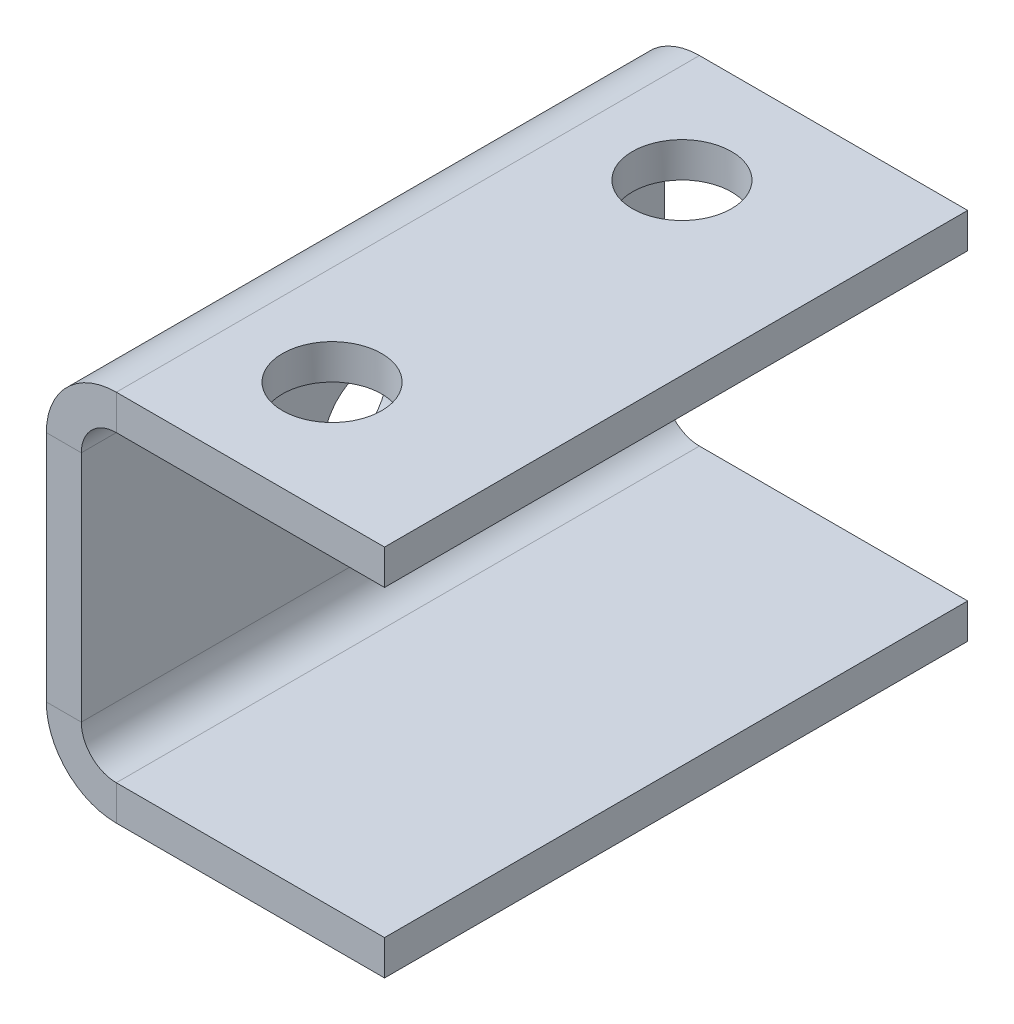
ISO-10303-21;
HEADER;
FILE_DESCRIPTION(('STEP AP214'),'2;1');
FILE_NAME('part.step','',(''),(''),'','','');
FILE_SCHEMA(('AUTOMOTIVE_DESIGN { 1 0 10303 214 1 1 1 1 }'));
ENDSEC;
DATA;
#1=APPLICATION_CONTEXT('core data for automotive mechanical design processes');
#2=APPLICATION_PROTOCOL_DEFINITION('international standard','automotive_design',2000,#1);
#3=PRODUCT_CONTEXT('',#1,'mechanical');
#4=PRODUCT('Part','Part','',(#3));
#5=PRODUCT_RELATED_PRODUCT_CATEGORY('part','',(#4));
#6=PRODUCT_DEFINITION_FORMATION('','',#4);
#7=PRODUCT_DEFINITION_CONTEXT('part definition',#1,'design');
#8=PRODUCT_DEFINITION('design','',#6,#7);
#9=PRODUCT_DEFINITION_SHAPE('','',#8);
#10=(LENGTH_UNIT() NAMED_UNIT(*) SI_UNIT(.MILLI.,.METRE.));
#11=(NAMED_UNIT(*) PLANE_ANGLE_UNIT() SI_UNIT($,.RADIAN.));
#12=(NAMED_UNIT(*) SI_UNIT($,.STERADIAN.) SOLID_ANGLE_UNIT());
#13=UNCERTAINTY_MEASURE_WITH_UNIT(LENGTH_MEASURE(1.E-05),#10,'distance_accuracy_value','');
#14=(GEOMETRIC_REPRESENTATION_CONTEXT(3) GLOBAL_UNCERTAINTY_ASSIGNED_CONTEXT((#13)) GLOBAL_UNIT_ASSIGNED_CONTEXT((#10,
#11,#12)) REPRESENTATION_CONTEXT('',''));
#15=CARTESIAN_POINT('',(0.,0.,0.));
#16=DIRECTION('',(0.,0.,1.));
#17=DIRECTION('',(1.,0.,0.));
#18=AXIS2_PLACEMENT_3D('',#15,#16,#17);
#19=CARTESIAN_POINT('',(6.00000000000012,-25.9999999999997,100.000000000002));
#20=DIRECTION('',(0.,0.,1.00000000000001));
#21=DIRECTION('',(1.,0.,0.));
#22=AXIS2_PLACEMENT_3D('',#19,#20,#21);
#23=PLANE('',#22);
#24=DIRECTION('',(0.,-1.,0.));
#25=VECTOR('',#24,1.);
#26=CARTESIAN_POINT('',(6.00000000000012,-25.9999999999997,100.000000000002));
#27=LINE('',#26,#25);
#28=CARTESIAN_POINT('',(6.00000000000012,-25.9999999999997,100.000000000002));
#29=VERTEX_POINT('',#28);
#30=CARTESIAN_POINT('',(6.00000000000012,-31.9999999999996,100.000000000002));
#31=VERTEX_POINT('',#30);
#32=EDGE_CURVE('E11',#29,#31,#27,.T.);
#33=ORIENTED_EDGE('',*,*,#32,.F.);
#34=CARTESIAN_POINT('',(6.00000000000012,-19.9999999999997,100.000000000002));
#35=DIRECTION('',(0.,0.,1.00000000000001));
#36=DIRECTION('',(1.,0.,0.));
#37=AXIS2_PLACEMENT_3D('',#34,#35,#36);
#38=CIRCLE('',#37,6.);
#39=CARTESIAN_POINT('',(1.11022302462516E-13,-19.9999999999996,100.000000000001));
#40=VERTEX_POINT('',#39);
#41=EDGE_CURVE('E150',#29,#40,#38,.F.);
#42=ORIENTED_EDGE('',*,*,#41,.T.);
#43=DIRECTION('',(1.,0.,0.));
#44=VECTOR('',#43,1.);
#45=CARTESIAN_POINT('',(-5.99999999999989,-19.9999999999996,100.000000000001));
#46=LINE('',#45,#44);
#47=CARTESIAN_POINT('',(-5.99999999999989,-19.9999999999996,100.000000000001));
#48=VERTEX_POINT('',#47);
#49=EDGE_CURVE('E48',#48,#40,#46,.T.);
#50=ORIENTED_EDGE('',*,*,#49,.F.);
#51=CARTESIAN_POINT('',(6.00000000000012,-19.9999999999997,100.000000000002));
#52=DIRECTION('',(0.,0.,1.00000000000001));
#53=DIRECTION('',(1.,0.,0.));
#54=AXIS2_PLACEMENT_3D('',#51,#52,#53);
#55=CIRCLE('',#54,12.);
#56=EDGE_CURVE('E245',#31,#48,#55,.F.);
#57=ORIENTED_EDGE('',*,*,#56,.F.);
#58=EDGE_LOOP('',(#33,#42,#50,#57));
#59=FACE_BOUND('',#58,.T.);
#60=ADVANCED_FACE('F40',(#59),#23,.T.);
#61=CARTESIAN_POINT('',(-5.99999999999989,-19.9999999999996,100.000000000001));
#62=DIRECTION('',(0.,0.,1.00000000000001));
#63=DIRECTION('',(1.,0.,0.));
#64=AXIS2_PLACEMENT_3D('',#61,#62,#63);
#65=PLANE('',#64);
#66=DIRECTION('',(-1.,0.,0.));
#67=VECTOR('',#66,1.);
#68=CARTESIAN_POINT('',(1.11022302462516E-13,-25.9999999999996,100.000000000002));
#69=LINE('',#68,#67);
#70=CARTESIAN_POINT('',(52.0000000000001,-25.9999999999999,100.));
#71=VERTEX_POINT('',#70);
#72=EDGE_CURVE('E155',#71,#29,#69,.T.);
#73=ORIENTED_EDGE('',*,*,#72,.T.);
#74=ORIENTED_EDGE('',*,*,#32,.T.);
#75=DIRECTION('',(1.,0.,0.));
#76=VECTOR('',#75,1.);
#77=CARTESIAN_POINT('',(1.11022302462516E-13,-31.9999999999996,100.000000000002));
#78=LINE('',#77,#76);
#79=CARTESIAN_POINT('',(52.0000000000001,-32.,100.));
#80=VERTEX_POINT('',#79);
#81=EDGE_CURVE('E258',#80,#31,#78,.F.);
#82=ORIENTED_EDGE('',*,*,#81,.F.);
#83=DIRECTION('',(0.,-1.,0.));
#84=VECTOR('',#83,1.);
#85=CARTESIAN_POINT('',(52.0000000000001,-25.9999999999999,100.));
#86=LINE('',#85,#84);
#87=EDGE_CURVE('E260',#71,#80,#86,.T.);
#88=ORIENTED_EDGE('',*,*,#87,.F.);
#89=EDGE_LOOP('',(#73,#74,#82,#88));
#90=FACE_BOUND('',#89,.T.);
#91=ADVANCED_FACE('F271',(#90),#65,.T.);
#92=CARTESIAN_POINT('',(1.11022302462516E-13,-19.9999999999999,1.11022302462516E-13));
#93=DIRECTION('',(0.,0.,-1.00000000000001));
#94=DIRECTION('',(-1.,0.,0.));
#95=AXIS2_PLACEMENT_3D('',#92,#93,#94);
#96=PLANE('',#95);
#97=DIRECTION('',(-1.,0.,0.));
#98=VECTOR('',#97,1.);
#99=CARTESIAN_POINT('',(1.11022302462516E-13,-19.9999999999999,1.11022302462516E-13));
#100=LINE('',#99,#98);
#101=CARTESIAN_POINT('',(1.11022302462516E-13,-19.9999999999999,1.11022302462516E-13));
#102=VERTEX_POINT('',#101);
#103=CARTESIAN_POINT('',(-5.99999999999989,-19.9999999999999,1.0547118733939E-12));
#104=VERTEX_POINT('',#103);
#105=EDGE_CURVE('E148',#102,#104,#100,.T.);
#106=ORIENTED_EDGE('',*,*,#105,.F.);
#107=CARTESIAN_POINT('',(6.00000000000012,-20.,1.11022302462516E-13));
#108=DIRECTION('',(0.,0.,1.00000000000001));
#109=DIRECTION('',(1.,0.,0.));
#110=AXIS2_PLACEMENT_3D('',#107,#108,#109);
#111=CIRCLE('',#110,6.);
#112=CARTESIAN_POINT('',(6.00000000000012,-26.,1.11022302462516E-13));
#113=VERTEX_POINT('',#112);
#114=EDGE_CURVE('E162',#113,#102,#111,.F.);
#115=ORIENTED_EDGE('',*,*,#114,.F.);
#116=DIRECTION('',(0.,1.,0.));
#117=VECTOR('',#116,1.);
#118=CARTESIAN_POINT('',(6.00000000000012,-32.,1.11022302462516E-13));
#119=LINE('',#118,#117);
#120=CARTESIAN_POINT('',(6.00000000000012,-32.,1.11022302462516E-13));
#121=VERTEX_POINT('',#120);
#122=EDGE_CURVE('E236',#121,#113,#119,.T.);
#123=ORIENTED_EDGE('',*,*,#122,.F.);
#124=CARTESIAN_POINT('',(6.00000000000012,-20.,1.11022302462516E-13));
#125=DIRECTION('',(0.,0.,1.00000000000001));
#126=DIRECTION('',(1.,0.,0.));
#127=AXIS2_PLACEMENT_3D('',#124,#125,#126);
#128=CIRCLE('',#127,12.);
#129=EDGE_CURVE('E190',#121,#104,#128,.F.);
#130=ORIENTED_EDGE('',*,*,#129,.T.);
#131=EDGE_LOOP('',(#106,#115,#123,#130));
#132=FACE_BOUND('',#131,.T.);
#133=ADVANCED_FACE('F250',(#132),#96,.T.);
#134=CARTESIAN_POINT('',(6.00000000000012,-32.,1.11022302462516E-13));
#135=DIRECTION('',(0.,0.,-1.00000000000001));
#136=DIRECTION('',(-1.,0.,0.));
#137=AXIS2_PLACEMENT_3D('',#134,#135,#136);
#138=PLANE('',#137);
#139=DIRECTION('',(0.,1.,0.));
#140=VECTOR('',#139,1.);
#141=CARTESIAN_POINT('',(-6.66133814775094E-13,26.,0.));
#142=LINE('',#141,#140);
#143=CARTESIAN_POINT('',(0.,20.,0.));
#144=VERTEX_POINT('',#143);
#145=EDGE_CURVE('E203',#102,#144,#142,.T.);
#146=ORIENTED_EDGE('',*,*,#145,.F.);
#147=ORIENTED_EDGE('',*,*,#105,.T.);
#148=DIRECTION('',(0.,1.,0.));
#149=VECTOR('',#148,1.);
#150=CARTESIAN_POINT('',(-6.00000000000067,26.,2.77555756156289E-13));
#151=LINE('',#150,#149);
#152=CARTESIAN_POINT('',(-6.00000000000006,20.,2.77555756156289E-13));
#153=VERTEX_POINT('',#152);
#154=EDGE_CURVE('E188',#104,#153,#151,.T.);
#155=ORIENTED_EDGE('',*,*,#154,.T.);
#156=DIRECTION('',(1.,0.,0.));
#157=VECTOR('',#156,1.);
#158=CARTESIAN_POINT('',(-6.00000000000006,20.,2.77555756156289E-13));
#159=LINE('',#158,#157);
#160=EDGE_CURVE('E97',#153,#144,#159,.T.);
#161=ORIENTED_EDGE('',*,*,#160,.T.);
#162=EDGE_LOOP('',(#146,#147,#155,#161));
#163=FACE_BOUND('',#162,.T.);
#164=ADVANCED_FACE('F238',(#163),#138,.T.);
#165=CARTESIAN_POINT('',(0.,20.0000000000004,99.9999999999999));
#166=DIRECTION('',(0.,0.,1.00000000000001));
#167=DIRECTION('',(1.,0.,0.));
#168=AXIS2_PLACEMENT_3D('',#165,#166,#167);
#169=PLANE('',#168);
#170=DIRECTION('',(-1.,0.,0.));
#171=VECTOR('',#170,1.);
#172=CARTESIAN_POINT('',(0.,20.0000000000004,99.9999999999999));
#173=LINE('',#172,#171);
#174=CARTESIAN_POINT('',(0.,20.0000000000004,99.9999999999999));
#175=VERTEX_POINT('',#174);
#176=CARTESIAN_POINT('',(-6.00000000000001,20.0000000000004,99.9999999999999));
#177=VERTEX_POINT('',#176);
#178=EDGE_CURVE('E234',#175,#177,#173,.T.);
#179=ORIENTED_EDGE('',*,*,#178,.F.);
#180=CARTESIAN_POINT('',(6.00000000000001,20.0000000000004,100.));
#181=DIRECTION('',(0.,0.,1.00000000000001));
#182=DIRECTION('',(1.,0.,0.));
#183=AXIS2_PLACEMENT_3D('',#180,#181,#182);
#184=CIRCLE('',#183,6.);
#185=CARTESIAN_POINT('',(5.99999999999939,26.0000000000004,100.));
#186=VERTEX_POINT('',#185);
#187=EDGE_CURVE('E170',#175,#186,#184,.F.);
#188=ORIENTED_EDGE('',*,*,#187,.T.);
#189=DIRECTION('',(0.,-1.,0.));
#190=VECTOR('',#189,1.);
#191=CARTESIAN_POINT('',(5.99999999999939,32.0000000000004,100.));
#192=LINE('',#191,#190);
#193=CARTESIAN_POINT('',(5.99999999999939,32.0000000000004,100.));
#194=VERTEX_POINT('',#193);
#195=EDGE_CURVE('E56',#194,#186,#192,.T.);
#196=ORIENTED_EDGE('',*,*,#195,.F.);
#197=CARTESIAN_POINT('',(6.00000000000001,20.0000000000004,100.));
#198=DIRECTION('',(0.,0.,1.00000000000001));
#199=DIRECTION('',(1.,0.,0.));
#200=AXIS2_PLACEMENT_3D('',#197,#198,#199);
#201=CIRCLE('',#200,12.);
#202=EDGE_CURVE('E262',#177,#194,#201,.F.);
#203=ORIENTED_EDGE('',*,*,#202,.F.);
#204=EDGE_LOOP('',(#179,#188,#196,#203));
#205=FACE_BOUND('',#204,.T.);
#206=ADVANCED_FACE('F297',(#205),#169,.T.);
#207=CARTESIAN_POINT('',(5.99999999999939,32.0000000000004,100.));
#208=DIRECTION('',(0.,0.,1.00000000000001));
#209=DIRECTION('',(1.,0.,0.));
#210=AXIS2_PLACEMENT_3D('',#207,#208,#209);
#211=PLANE('',#210);
#212=DIRECTION('',(0.,1.,0.));
#213=VECTOR('',#212,1.);
#214=CARTESIAN_POINT('',(-6.10622663543836E-13,26.0000000000004,100.));
#215=LINE('',#214,#213);
#216=EDGE_CURVE('E140',#40,#175,#215,.T.);
#217=ORIENTED_EDGE('',*,*,#216,.T.);
#218=ORIENTED_EDGE('',*,*,#178,.T.);
#219=DIRECTION('',(0.,1.,0.));
#220=VECTOR('',#219,1.);
#221=CARTESIAN_POINT('',(-6.00000000000062,26.0000000000004,99.9999999999999));
#222=LINE('',#221,#220);
#223=EDGE_CURVE('E143',#48,#177,#222,.T.);
#224=ORIENTED_EDGE('',*,*,#223,.F.);
#225=ORIENTED_EDGE('',*,*,#49,.T.);
#226=EDGE_LOOP('',(#217,#218,#224,#225));
#227=FACE_BOUND('',#226,.T.);
#228=ADVANCED_FACE('F138',(#227),#211,.T.);
#229=CARTESIAN_POINT('',(5.99999999999934,26.,0.));
#230=DIRECTION('',(0.,0.,-1.00000000000001));
#231=DIRECTION('',(-1.,0.,0.));
#232=AXIS2_PLACEMENT_3D('',#229,#230,#231);
#233=PLANE('',#232);
#234=DIRECTION('',(0.,1.,0.));
#235=VECTOR('',#234,1.);
#236=CARTESIAN_POINT('',(5.99999999999934,26.,0.));
#237=LINE('',#236,#235);
#238=CARTESIAN_POINT('',(5.99999999999934,26.,0.));
#239=VERTEX_POINT('',#238);
#240=CARTESIAN_POINT('',(5.99999999999934,32.,0.));
#241=VERTEX_POINT('',#240);
#242=EDGE_CURVE('E104',#239,#241,#237,.T.);
#243=ORIENTED_EDGE('',*,*,#242,.F.);
#244=CARTESIAN_POINT('',(5.99999999999995,20.,0.));
#245=DIRECTION('',(0.,0.,1.00000000000001));
#246=DIRECTION('',(1.,0.,0.));
#247=AXIS2_PLACEMENT_3D('',#244,#245,#246);
#248=CIRCLE('',#247,6.);
#249=EDGE_CURVE('E205',#144,#239,#248,.F.);
#250=ORIENTED_EDGE('',*,*,#249,.F.);
#251=ORIENTED_EDGE('',*,*,#160,.F.);
#252=CARTESIAN_POINT('',(5.99999999999995,20.,0.));
#253=DIRECTION('',(0.,0.,1.00000000000001));
#254=DIRECTION('',(1.,0.,0.));
#255=AXIS2_PLACEMENT_3D('',#252,#253,#254);
#256=CIRCLE('',#255,12.);
#257=EDGE_CURVE('E186',#153,#241,#256,.F.);
#258=ORIENTED_EDGE('',*,*,#257,.T.);
#259=EDGE_LOOP('',(#243,#250,#251,#258));
#260=FACE_BOUND('',#259,.T.);
#261=ADVANCED_FACE('F303',(#260),#233,.T.);
#262=CARTESIAN_POINT('',(-6.00000000000006,20.,2.77555756156289E-13));
#263=DIRECTION('',(0.,0.,-1.00000000000001));
#264=DIRECTION('',(-1.,0.,0.));
#265=AXIS2_PLACEMENT_3D('',#262,#263,#264);
#266=PLANE('',#265);
#267=DIRECTION('',(1.,0.,0.));
#268=VECTOR('',#267,1.);
#269=CARTESIAN_POINT('',(-6.66133814775094E-13,26.,0.));
#270=LINE('',#269,#268);
#271=CARTESIAN_POINT('',(51.9999999999993,25.9999999999997,8.32667268468867E-13));
#272=VERTEX_POINT('',#271);
#273=EDGE_CURVE('E176',#239,#272,#270,.T.);
#274=ORIENTED_EDGE('',*,*,#273,.F.);
#275=ORIENTED_EDGE('',*,*,#242,.T.);
#276=DIRECTION('',(1.,0.,0.));
#277=VECTOR('',#276,1.);
#278=CARTESIAN_POINT('',(-6.66133814775094E-13,32.,0.));
#279=LINE('',#278,#277);
#280=CARTESIAN_POINT('',(51.9999999999993,31.9999999999997,8.32667268468867E-13));
#281=VERTEX_POINT('',#280);
#282=EDGE_CURVE('E183',#241,#281,#279,.T.);
#283=ORIENTED_EDGE('',*,*,#282,.T.);
#284=DIRECTION('',(0.,-1.,0.));
#285=VECTOR('',#284,1.);
#286=CARTESIAN_POINT('',(51.9999999999993,31.9999999999997,8.32667268468867E-13));
#287=LINE('',#286,#285);
#288=EDGE_CURVE('E179',#281,#272,#287,.T.);
#289=ORIENTED_EDGE('',*,*,#288,.T.);
#290=EDGE_LOOP('',(#274,#275,#283,#289));
#291=FACE_BOUND('',#290,.T.);
#292=ADVANCED_FACE('F306',(#291),#266,.T.);
#293=CARTESIAN_POINT('',(-6.10622663543836E-13,26.0000000000004,100.));
#294=DIRECTION('',(0.,1.,0.));
#295=DIRECTION('',(0.,0.,1.00000000000001));
#296=AXIS2_PLACEMENT_3D('',#293,#294,#295);
#297=PLANE('',#296);
#298=CARTESIAN_POINT('',(22.9999999999994,26.,80.0000000000004));
#299=DIRECTION('',(0.,1.,0.));
#300=DIRECTION('',(0.,0.,1.00000000000001));
#301=AXIS2_PLACEMENT_3D('',#298,#299,#300);
#302=CIRCLE('',#301,8.50000000000004);
#303=CARTESIAN_POINT('',(22.9999999999994,26.0000000000001,88.5000000000004));
#304=VERTEX_POINT('',#303);
#305=EDGE_CURVE('E442',#304,#304,#302,.T.);
#306=ORIENTED_EDGE('',*,*,#305,.T.);
#307=EDGE_LOOP('',(#306));
#308=FACE_BOUND('',#307,.T.);
#309=CARTESIAN_POINT('',(23.,26.,20.));
#310=DIRECTION('',(0.,1.,0.));
#311=DIRECTION('',(0.,0.,1.00000000000001));
#312=AXIS2_PLACEMENT_3D('',#309,#310,#311);
#313=CIRCLE('',#312,8.5);
#314=CARTESIAN_POINT('',(23.,26.,28.5000000000001));
#315=VERTEX_POINT('',#314);
#316=EDGE_CURVE('E180',#315,#315,#313,.T.);
#317=ORIENTED_EDGE('',*,*,#316,.T.);
#318=EDGE_LOOP('',(#317));
#319=FACE_BOUND('',#318,.T.);
#320=ORIENTED_EDGE('',*,*,#273,.T.);
#321=DIRECTION('',(0.,0.,-1.00000000000001));
#322=VECTOR('',#321,1.);
#323=CARTESIAN_POINT('',(51.9999999999994,26.,99.999999999999));
#324=LINE('',#323,#322);
#325=CARTESIAN_POINT('',(51.9999999999994,26.,99.999999999999));
#326=VERTEX_POINT('',#325);
#327=EDGE_CURVE('E229',#326,#272,#324,.T.);
#328=ORIENTED_EDGE('',*,*,#327,.F.);
#329=DIRECTION('',(1.,0.,0.));
#330=VECTOR('',#329,1.);
#331=CARTESIAN_POINT('',(-6.10622663543836E-13,26.0000000000004,100.));
#332=LINE('',#331,#330);
#333=EDGE_CURVE('E110',#186,#326,#332,.T.);
#334=ORIENTED_EDGE('',*,*,#333,.F.);
#335=DIRECTION('',(0.,0.,-1.00000000000001));
#336=VECTOR('',#335,1.);
#337=CARTESIAN_POINT('',(5.99999999999939,26.0000000000004,100.));
#338=LINE('',#337,#336);
#339=EDGE_CURVE('E172',#186,#239,#338,.T.);
#340=ORIENTED_EDGE('',*,*,#339,.T.);
#341=EDGE_LOOP('',(#320,#328,#334,#340));
#342=FACE_BOUND('',#341,.T.);
#343=ADVANCED_FACE('F309',(#308,#319,#342),#297,.F.);
#344=CARTESIAN_POINT('',(51.9999999999994,32.,99.999999999999));
#345=DIRECTION('',(1.,0.,0.));
#346=DIRECTION('',(0.,0.,-1.00000000000001));
#347=AXIS2_PLACEMENT_3D('',#344,#345,#346);
#348=PLANE('',#347);
#349=ORIENTED_EDGE('',*,*,#288,.F.);
#350=DIRECTION('',(0.,0.,-1.00000000000001));
#351=VECTOR('',#350,1.);
#352=CARTESIAN_POINT('',(51.9999999999994,32.,99.999999999999));
#353=LINE('',#352,#351);
#354=CARTESIAN_POINT('',(51.9999999999994,32.,99.999999999999));
#355=VERTEX_POINT('',#354);
#356=EDGE_CURVE('E227',#355,#281,#353,.T.);
#357=ORIENTED_EDGE('',*,*,#356,.F.);
#358=DIRECTION('',(0.,-1.,0.));
#359=VECTOR('',#358,1.);
#360=CARTESIAN_POINT('',(51.9999999999994,32.,99.999999999999));
#361=LINE('',#360,#359);
#362=EDGE_CURVE('E453',#355,#326,#361,.T.);
#363=ORIENTED_EDGE('',*,*,#362,.T.);
#364=ORIENTED_EDGE('',*,*,#327,.T.);
#365=EDGE_LOOP('',(#349,#357,#363,#364));
#366=FACE_BOUND('',#365,.T.);
#367=ADVANCED_FACE('F313',(#366),#348,.T.);
#368=CARTESIAN_POINT('',(-6.10622663543836E-13,32.0000000000004,100.));
#369=DIRECTION('',(0.,1.,0.));
#370=DIRECTION('',(0.,0.,1.00000000000001));
#371=AXIS2_PLACEMENT_3D('',#368,#369,#370);
#372=PLANE('',#371);
#373=CARTESIAN_POINT('',(22.9999999999994,32.0000000000001,80.0000000000004));
#374=DIRECTION('',(0.,-1.,0.));
#375=DIRECTION('',(0.,0.,-1.00000000000001));
#376=AXIS2_PLACEMENT_3D('',#373,#374,#375);
#377=CIRCLE('',#376,8.50000000000004);
#378=CARTESIAN_POINT('',(22.9999999999994,32.,71.5000000000003));
#379=VERTEX_POINT('',#378);
#380=EDGE_CURVE('E439',#379,#379,#377,.T.);
#381=ORIENTED_EDGE('',*,*,#380,.T.);
#382=EDGE_LOOP('',(#381));
#383=FACE_BOUND('',#382,.T.);
#384=CARTESIAN_POINT('',(23.,32.,20.));
#385=DIRECTION('',(0.,-1.,0.));
#386=DIRECTION('',(0.,0.,-1.00000000000001));
#387=AXIS2_PLACEMENT_3D('',#384,#385,#386);
#388=CIRCLE('',#387,8.5);
#389=CARTESIAN_POINT('',(23.,32.,11.5));
#390=VERTEX_POINT('',#389);
#391=EDGE_CURVE('E445',#390,#390,#388,.T.);
#392=ORIENTED_EDGE('',*,*,#391,.T.);
#393=EDGE_LOOP('',(#392));
#394=FACE_BOUND('',#393,.T.);
#395=ORIENTED_EDGE('',*,*,#282,.F.);
#396=DIRECTION('',(0.,0.,-1.00000000000001));
#397=VECTOR('',#396,1.);
#398=CARTESIAN_POINT('',(5.99999999999939,32.0000000000004,100.));
#399=LINE('',#398,#397);
#400=EDGE_CURVE('E224',#194,#241,#399,.T.);
#401=ORIENTED_EDGE('',*,*,#400,.F.);
#402=DIRECTION('',(1.,0.,0.));
#403=VECTOR('',#402,1.);
#404=CARTESIAN_POINT('',(-6.10622663543836E-13,32.0000000000004,100.));
#405=LINE('',#404,#403);
#406=EDGE_CURVE('E456',#194,#355,#405,.T.);
#407=ORIENTED_EDGE('',*,*,#406,.T.);
#408=ORIENTED_EDGE('',*,*,#356,.T.);
#409=EDGE_LOOP('',(#395,#401,#407,#408));
#410=FACE_BOUND('',#409,.T.);
#411=ADVANCED_FACE('F317',(#383,#394,#410),#372,.T.);
#412=CARTESIAN_POINT('',(6.00000000000001,20.0000000000004,100.));
#413=DIRECTION('',(0.,0.,-1.00000000000001));
#414=DIRECTION('',(-1.,0.,0.));
#415=AXIS2_PLACEMENT_3D('',#412,#413,#414);
#416=CYLINDRICAL_SURFACE('',#415,12.);
#417=ORIENTED_EDGE('',*,*,#257,.F.);
#418=DIRECTION('',(0.,0.,-1.00000000000001));
#419=VECTOR('',#418,1.);
#420=CARTESIAN_POINT('',(-6.00000000000001,20.0000000000004,99.9999999999999));
#421=LINE('',#420,#419);
#422=EDGE_CURVE('E221',#177,#153,#421,.T.);
#423=ORIENTED_EDGE('',*,*,#422,.F.);
#424=ORIENTED_EDGE('',*,*,#202,.T.);
#425=ORIENTED_EDGE('',*,*,#400,.T.);
#426=EDGE_LOOP('',(#417,#423,#424,#425));
#427=FACE_BOUND('',#426,.T.);
#428=ADVANCED_FACE('F321',(#427),#416,.T.);
#429=CARTESIAN_POINT('',(-6.00000000000062,26.0000000000004,99.9999999999999));
#430=DIRECTION('',(-1.,0.,0.));
#431=DIRECTION('',(0.,0.,1.00000000000001));
#432=AXIS2_PLACEMENT_3D('',#429,#430,#431);
#433=PLANE('',#432);
#434=CARTESIAN_POINT('',(-6.00000000000017,-2.77555756156289E-13,50.0000000000001));
#435=DIRECTION('',(1.,0.,0.));
#436=DIRECTION('',(0.,0.,-1.00000000000001));
#437=AXIS2_PLACEMENT_3D('',#434,#435,#436);
#438=CIRCLE('',#437,8.50000000000001);
#439=CARTESIAN_POINT('',(-6.00000000000017,-3.02091685000505E-13,41.5));
#440=VERTEX_POINT('',#439);
#441=EDGE_CURVE('E434',#440,#440,#438,.T.);
#442=ORIENTED_EDGE('',*,*,#441,.T.);
#443=EDGE_LOOP('',(#442));
#444=FACE_BOUND('',#443,.T.);
#445=ORIENTED_EDGE('',*,*,#154,.F.);
#446=DIRECTION('',(0.,0.,-1.00000000000001));
#447=VECTOR('',#446,1.);
#448=CARTESIAN_POINT('',(-5.99999999999989,-19.9999999999996,100.000000000001));
#449=LINE('',#448,#447);
#450=EDGE_CURVE('E218',#48,#104,#449,.T.);
#451=ORIENTED_EDGE('',*,*,#450,.F.);
#452=ORIENTED_EDGE('',*,*,#223,.T.);
#453=ORIENTED_EDGE('',*,*,#422,.T.);
#454=EDGE_LOOP('',(#445,#451,#452,#453));
#455=FACE_BOUND('',#454,.T.);
#456=ADVANCED_FACE('F247',(#444,#455),#433,.T.);
#457=CARTESIAN_POINT('',(6.00000000000012,-19.9999999999997,100.000000000002));
#458=DIRECTION('',(0.,0.,-1.00000000000001));
#459=DIRECTION('',(-1.,0.,0.));
#460=AXIS2_PLACEMENT_3D('',#457,#458,#459);
#461=CYLINDRICAL_SURFACE('',#460,12.);
#462=ORIENTED_EDGE('',*,*,#129,.F.);
#463=DIRECTION('',(0.,0.,-1.00000000000001));
#464=VECTOR('',#463,1.);
#465=CARTESIAN_POINT('',(6.00000000000012,-31.9999999999996,100.000000000002));
#466=LINE('',#465,#464);
#467=EDGE_CURVE('E215',#31,#121,#466,.T.);
#468=ORIENTED_EDGE('',*,*,#467,.F.);
#469=ORIENTED_EDGE('',*,*,#56,.T.);
#470=ORIENTED_EDGE('',*,*,#450,.T.);
#471=EDGE_LOOP('',(#462,#468,#469,#470));
#472=FACE_BOUND('',#471,.T.);
#473=ADVANCED_FACE('F243',(#472),#461,.T.);
#474=CARTESIAN_POINT('',(1.11022302462516E-13,-31.9999999999996,100.000000000002));
#475=DIRECTION('',(0.,-1.,0.));
#476=DIRECTION('',(0.,0.,-1.00000000000001));
#477=AXIS2_PLACEMENT_3D('',#474,#475,#476);
#478=PLANE('',#477);
#479=DIRECTION('',(1.,0.,0.));
#480=VECTOR('',#479,1.);
#481=CARTESIAN_POINT('',(1.11022302462516E-13,-32.,1.11022302462516E-13));
#482=LINE('',#481,#480);
#483=CARTESIAN_POINT('',(52.0000000000001,-32.0000000000003,0.));
#484=VERTEX_POINT('',#483);
#485=EDGE_CURVE('E193',#484,#121,#482,.F.);
#486=ORIENTED_EDGE('',*,*,#485,.F.);
#487=DIRECTION('',(0.,0.,-1.00000000000001));
#488=VECTOR('',#487,1.);
#489=CARTESIAN_POINT('',(52.0000000000001,-32.,100.));
#490=LINE('',#489,#488);
#491=EDGE_CURVE('E213',#80,#484,#490,.T.);
#492=ORIENTED_EDGE('',*,*,#491,.F.);
#493=ORIENTED_EDGE('',*,*,#81,.T.);
#494=ORIENTED_EDGE('',*,*,#467,.T.);
#495=EDGE_LOOP('',(#486,#492,#493,#494));
#496=FACE_BOUND('',#495,.T.);
#497=ADVANCED_FACE('F256',(#496),#478,.T.);
#498=CARTESIAN_POINT('',(52.0000000000001,-25.9999999999999,100.));
#499=DIRECTION('',(1.,0.,0.));
#500=DIRECTION('',(0.,0.,-1.00000000000001));
#501=AXIS2_PLACEMENT_3D('',#498,#499,#500);
#502=PLANE('',#501);
#503=DIRECTION('',(0.,-1.,0.));
#504=VECTOR('',#503,1.);
#505=CARTESIAN_POINT('',(52.0000000000001,-26.0000000000003,0.));
#506=LINE('',#505,#504);
#507=CARTESIAN_POINT('',(52.0000000000001,-26.0000000000003,0.));
#508=VERTEX_POINT('',#507);
#509=EDGE_CURVE('E196',#508,#484,#506,.T.);
#510=ORIENTED_EDGE('',*,*,#509,.F.);
#511=DIRECTION('',(0.,0.,-1.00000000000001));
#512=VECTOR('',#511,1.);
#513=CARTESIAN_POINT('',(52.0000000000001,-25.9999999999999,100.));
#514=LINE('',#513,#512);
#515=EDGE_CURVE('E211',#71,#508,#514,.T.);
#516=ORIENTED_EDGE('',*,*,#515,.F.);
#517=ORIENTED_EDGE('',*,*,#87,.T.);
#518=ORIENTED_EDGE('',*,*,#491,.T.);
#519=EDGE_LOOP('',(#510,#516,#517,#518));
#520=FACE_BOUND('',#519,.T.);
#521=ADVANCED_FACE('F277',(#520),#502,.T.);
#522=CARTESIAN_POINT('',(1.11022302462516E-13,-25.9999999999996,100.000000000002));
#523=DIRECTION('',(0.,-1.,0.));
#524=DIRECTION('',(0.,0.,-1.00000000000001));
#525=AXIS2_PLACEMENT_3D('',#522,#523,#524);
#526=PLANE('',#525);
#527=DIRECTION('',(-1.,0.,0.));
#528=VECTOR('',#527,1.);
#529=CARTESIAN_POINT('',(1.11022302462516E-13,-26.,1.11022302462516E-13));
#530=LINE('',#529,#528);
#531=EDGE_CURVE('E199',#508,#113,#530,.T.);
#532=ORIENTED_EDGE('',*,*,#531,.T.);
#533=DIRECTION('',(0.,0.,-1.00000000000001));
#534=VECTOR('',#533,1.);
#535=CARTESIAN_POINT('',(6.00000000000012,-25.9999999999997,100.000000000002));
#536=LINE('',#535,#534);
#537=EDGE_CURVE('E164',#29,#113,#536,.T.);
#538=ORIENTED_EDGE('',*,*,#537,.F.);
#539=ORIENTED_EDGE('',*,*,#72,.F.);
#540=ORIENTED_EDGE('',*,*,#515,.T.);
#541=EDGE_LOOP('',(#532,#538,#539,#540));
#542=FACE_BOUND('',#541,.T.);
#543=ADVANCED_FACE('F273',(#542),#526,.F.);
#544=CARTESIAN_POINT('',(6.00000000000012,-19.9999999999997,100.000000000002));
#545=DIRECTION('',(0.,0.,-1.00000000000001));
#546=DIRECTION('',(-1.,0.,0.));
#547=AXIS2_PLACEMENT_3D('',#544,#545,#546);
#548=CYLINDRICAL_SURFACE('',#547,6.);
#549=ORIENTED_EDGE('',*,*,#114,.T.);
#550=DIRECTION('',(0.,0.,-1.00000000000001));
#551=VECTOR('',#550,1.);
#552=CARTESIAN_POINT('',(1.11022302462516E-13,-19.9999999999996,100.000000000001));
#553=LINE('',#552,#551);
#554=EDGE_CURVE('E159',#40,#102,#553,.T.);
#555=ORIENTED_EDGE('',*,*,#554,.F.);
#556=ORIENTED_EDGE('',*,*,#41,.F.);
#557=ORIENTED_EDGE('',*,*,#537,.T.);
#558=EDGE_LOOP('',(#549,#555,#556,#557));
#559=FACE_BOUND('',#558,.T.);
#560=ADVANCED_FACE('F160',(#559),#548,.F.);
#561=CARTESIAN_POINT('',(-6.10622663543836E-13,26.0000000000004,100.));
#562=DIRECTION('',(-1.,0.,0.));
#563=DIRECTION('',(0.,0.,1.00000000000001));
#564=AXIS2_PLACEMENT_3D('',#561,#562,#563);
#565=PLANE('',#564);
#566=CARTESIAN_POINT('',(-6.66133814775094E-13,-2.77555756156289E-13,50.0000000000001));
#567=DIRECTION('',(-1.,0.,0.));
#568=DIRECTION('',(0.,0.,1.00000000000001));
#569=AXIS2_PLACEMENT_3D('',#566,#567,#568);
#570=CIRCLE('',#569,8.50000000000001);
#571=CARTESIAN_POINT('',(-6.66133814775094E-13,-2.53019827312073E-13,58.5000000000002));
#572=VERTEX_POINT('',#571);
#573=EDGE_CURVE('E437',#572,#572,#570,.T.);
#574=ORIENTED_EDGE('',*,*,#573,.T.);
#575=EDGE_LOOP('',(#574));
#576=FACE_BOUND('',#575,.T.);
#577=ORIENTED_EDGE('',*,*,#145,.T.);
#578=DIRECTION('',(0.,0.,-1.00000000000001));
#579=VECTOR('',#578,1.);
#580=CARTESIAN_POINT('',(0.,20.0000000000004,99.9999999999999));
#581=LINE('',#580,#579);
#582=EDGE_CURVE('E165',#175,#144,#581,.T.);
#583=ORIENTED_EDGE('',*,*,#582,.F.);
#584=ORIENTED_EDGE('',*,*,#216,.F.);
#585=ORIENTED_EDGE('',*,*,#554,.T.);
#586=EDGE_LOOP('',(#577,#583,#584,#585));
#587=FACE_BOUND('',#586,.T.);
#588=ADVANCED_FACE('F167',(#576,#587),#565,.F.);
#589=CARTESIAN_POINT('',(6.00000000000001,20.0000000000004,100.));
#590=DIRECTION('',(0.,0.,-1.00000000000001));
#591=DIRECTION('',(-1.,0.,0.));
#592=AXIS2_PLACEMENT_3D('',#589,#590,#591);
#593=CYLINDRICAL_SURFACE('',#592,6.);
#594=ORIENTED_EDGE('',*,*,#249,.T.);
#595=ORIENTED_EDGE('',*,*,#339,.F.);
#596=ORIENTED_EDGE('',*,*,#187,.F.);
#597=ORIENTED_EDGE('',*,*,#582,.T.);
#598=EDGE_LOOP('',(#594,#595,#596,#597));
#599=FACE_BOUND('',#598,.T.);
#600=ADVANCED_FACE('F369',(#599),#593,.F.);
#601=CARTESIAN_POINT('',(6.00000000000001,20.0000000000004,100.));
#602=DIRECTION('',(0.,0.,1.00000000000001));
#603=DIRECTION('',(1.,0.,0.));
#604=AXIS2_PLACEMENT_3D('',#601,#602,#603);
#605=PLANE('',#604);
#606=ORIENTED_EDGE('',*,*,#333,.T.);
#607=ORIENTED_EDGE('',*,*,#362,.F.);
#608=ORIENTED_EDGE('',*,*,#406,.F.);
#609=ORIENTED_EDGE('',*,*,#195,.T.);
#610=EDGE_LOOP('',(#606,#607,#608,#609));
#611=FACE_BOUND('',#610,.T.);
#612=ADVANCED_FACE('F380',(#611),#605,.T.);
#613=CARTESIAN_POINT('',(5.99999999999995,20.,0.));
#614=DIRECTION('',(0.,0.,1.00000000000001));
#615=DIRECTION('',(1.,0.,0.));
#616=AXIS2_PLACEMENT_3D('',#613,#614,#615);
#617=PLANE('',#616);
#618=ORIENTED_EDGE('',*,*,#485,.T.);
#619=ORIENTED_EDGE('',*,*,#122,.T.);
#620=ORIENTED_EDGE('',*,*,#531,.F.);
#621=ORIENTED_EDGE('',*,*,#509,.T.);
#622=EDGE_LOOP('',(#618,#619,#620,#621));
#623=FACE_BOUND('',#622,.T.);
#624=ADVANCED_FACE('F275',(#623),#617,.F.);
#625=CARTESIAN_POINT('',(23.0000000000001,-32.001,20.0000000000001));
#626=DIRECTION('',(0.,1.,0.));
#627=DIRECTION('',(0.,0.,1.00000000000001));
#628=AXIS2_PLACEMENT_3D('',#625,#626,#627);
#629=CYLINDRICAL_SURFACE('',#628,8.5);
#630=ORIENTED_EDGE('',*,*,#391,.F.);
#631=EDGE_LOOP('',(#630));
#632=FACE_BOUND('',#631,.T.);
#633=ORIENTED_EDGE('',*,*,#316,.F.);
#634=EDGE_LOOP('',(#633));
#635=FACE_BOUND('',#634,.T.);
#636=ADVANCED_FACE('F398',(#632,#635),#629,.F.);
#637=CARTESIAN_POINT('',(23.0000000000001,-32.0009999999999,80.0000000000022));
#638=DIRECTION('',(0.,1.,0.));
#639=DIRECTION('',(0.,0.,1.00000000000001));
#640=AXIS2_PLACEMENT_3D('',#637,#638,#639);
#641=CYLINDRICAL_SURFACE('',#640,8.50000000000004);
#642=ORIENTED_EDGE('',*,*,#380,.F.);
#643=EDGE_LOOP('',(#642));
#644=FACE_BOUND('',#643,.T.);
#645=ORIENTED_EDGE('',*,*,#305,.F.);
#646=EDGE_LOOP('',(#645));
#647=FACE_BOUND('',#646,.T.);
#648=ADVANCED_FACE('F407',(#644,#647),#641,.F.);
#649=CARTESIAN_POINT('',(52.0009999999998,-3.05311331771918E-13,49.999999999999));
#650=DIRECTION('',(-1.,0.,0.));
#651=DIRECTION('',(0.,0.,1.00000000000001));
#652=AXIS2_PLACEMENT_3D('',#649,#650,#651);
#653=CYLINDRICAL_SURFACE('',#652,8.50000000000001);
#654=ORIENTED_EDGE('',*,*,#441,.F.);
#655=EDGE_LOOP('',(#654));
#656=FACE_BOUND('',#655,.T.);
#657=ORIENTED_EDGE('',*,*,#573,.F.);
#658=EDGE_LOOP('',(#657));
#659=FACE_BOUND('',#658,.T.);
#660=ADVANCED_FACE('F418',(#656,#659),#653,.F.);
#661=CLOSED_SHELL('',(#60,#91,#133,#164,#206,#228,#261,#292,#343,#367,#411,#428,#456,#473,#497,
#521,#543,#560,#588,#600,#612,#624,#636,#648,#660));
#662=MANIFOLD_SOLID_BREP('B2',#661);
#663=ADVANCED_BREP_SHAPE_REPRESENTATION('',(#18,#662),#14);
#664=SHAPE_DEFINITION_REPRESENTATION(#9,#663);
ENDSEC;
END-ISO-10303-21;
